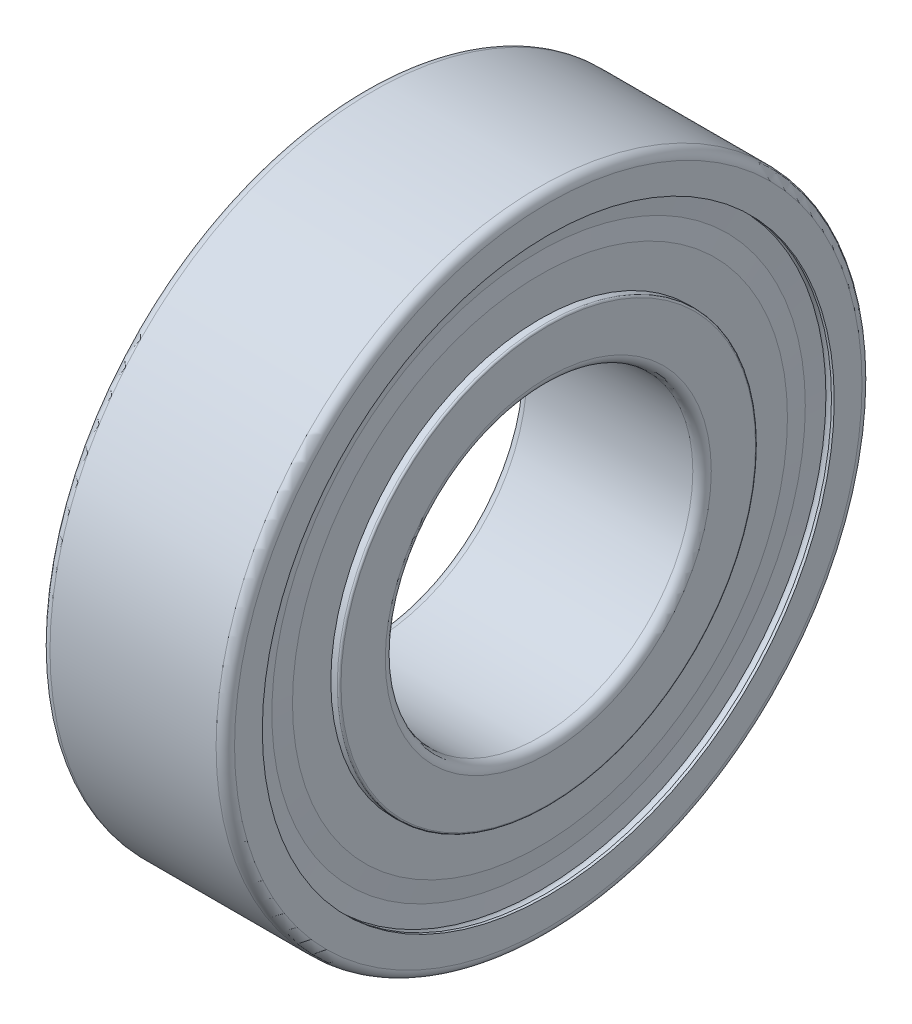
ISO-10303-21;
HEADER;
FILE_DESCRIPTION(('STEP AP214'),'2;1');
FILE_NAME('part.step','',(''),(''),'','','');
FILE_SCHEMA(('AUTOMOTIVE_DESIGN { 1 0 10303 214 1 1 1 1 }'));
ENDSEC;
DATA;
#1=APPLICATION_CONTEXT('core data for automotive mechanical design processes');
#2=APPLICATION_PROTOCOL_DEFINITION('international standard','automotive_design',2000,#1);
#3=PRODUCT_CONTEXT('',#1,'mechanical');
#4=PRODUCT('Part','Part','',(#3));
#5=PRODUCT_RELATED_PRODUCT_CATEGORY('part','',(#4));
#6=PRODUCT_DEFINITION_FORMATION('','',#4);
#7=PRODUCT_DEFINITION_CONTEXT('part definition',#1,'design');
#8=PRODUCT_DEFINITION('design','',#6,#7);
#9=PRODUCT_DEFINITION_SHAPE('','',#8);
#10=(LENGTH_UNIT() NAMED_UNIT(*) SI_UNIT(.MILLI.,.METRE.));
#11=(NAMED_UNIT(*) PLANE_ANGLE_UNIT() SI_UNIT($,.RADIAN.));
#12=(NAMED_UNIT(*) SI_UNIT($,.STERADIAN.) SOLID_ANGLE_UNIT());
#13=UNCERTAINTY_MEASURE_WITH_UNIT(LENGTH_MEASURE(1.E-05),#10,'distance_accuracy_value','');
#14=(GEOMETRIC_REPRESENTATION_CONTEXT(3) GLOBAL_UNCERTAINTY_ASSIGNED_CONTEXT((#13)) GLOBAL_UNIT_ASSIGNED_CONTEXT((#10,
#11,#12)) REPRESENTATION_CONTEXT('',''));
#15=CARTESIAN_POINT('',(0.,0.,0.));
#16=DIRECTION('',(0.,0.,1.));
#17=DIRECTION('',(1.,0.,0.));
#18=AXIS2_PLACEMENT_3D('',#15,#16,#17);
#19=CARTESIAN_POINT('',(50.,0.,0.));
#20=DIRECTION('',(1.,0.,0.));
#21=DIRECTION('',(0.,0.,-1.));
#22=AXIS2_PLACEMENT_3D('',#19,#20,#21);
#23=CYLINDRICAL_SURFACE('',#22,18.595);
#24=CARTESIAN_POINT('',(11.46,0.,0.));
#25=DIRECTION('',(1.,0.,0.));
#26=DIRECTION('',(0.,0.,-1.));
#27=AXIS2_PLACEMENT_3D('',#24,#25,#26);
#28=CIRCLE('',#27,18.595);
#29=CARTESIAN_POINT('',(11.46,0.,-18.595));
#30=VERTEX_POINT('',#29);
#31=EDGE_CURVE('P0_E11',#30,#30,#28,.T.);
#32=ORIENTED_EDGE('',*,*,#31,.F.);
#33=EDGE_LOOP('',(#32));
#34=FACE_BOUND('',#33,.T.);
#35=CARTESIAN_POINT('',(11.28,0.,0.));
#36=DIRECTION('',(1.,0.,0.));
#37=DIRECTION('',(0.,0.,-1.));
#38=AXIS2_PLACEMENT_3D('',#35,#36,#37);
#39=CIRCLE('',#38,18.595);
#40=CARTESIAN_POINT('',(11.28,0.,-18.595));
#41=VERTEX_POINT('',#40);
#42=EDGE_CURVE('P0_E187',#41,#41,#39,.T.);
#43=ORIENTED_EDGE('',*,*,#42,.T.);
#44=EDGE_LOOP('',(#43));
#45=FACE_BOUND('',#44,.T.);
#46=ADVANCED_FACE('P0_F17',(#34,#45),#23,.T.);
#47=CARTESIAN_POINT('',(11.37,0.,0.));
#48=DIRECTION('',(1.,0.,0.));
#49=DIRECTION('',(0.,0.,-1.));
#50=AXIS2_PLACEMENT_3D('',#47,#48,#49);
#51=CONICAL_SURFACE('',#50,17.34375,1.49899191472693);
#52=CARTESIAN_POINT('',(11.37,0.,0.));
#53=DIRECTION('',(1.,0.,0.));
#54=DIRECTION('',(0.,0.,-1.));
#55=AXIS2_PLACEMENT_3D('',#52,#53,#54);
#56=CIRCLE('',#55,17.34375);
#57=CARTESIAN_POINT('',(11.37,0.,-17.34375));
#58=VERTEX_POINT('',#57);
#59=EDGE_CURVE('P0_E28',#58,#58,#56,.T.);
#60=ORIENTED_EDGE('',*,*,#59,.F.);
#61=EDGE_LOOP('',(#60));
#62=FACE_BOUND('',#61,.T.);
#63=ORIENTED_EDGE('',*,*,#31,.T.);
#64=EDGE_LOOP('',(#63));
#65=FACE_BOUND('',#64,.T.);
#66=ADVANCED_FACE('P0_F268',(#62,#65),#51,.F.);
#67=CARTESIAN_POINT('',(11.46,0.,0.));
#68=DIRECTION('',(-1.,0.,0.));
#69=DIRECTION('',(0.,0.,1.));
#70=AXIS2_PLACEMENT_3D('',#67,#68,#69);
#71=CONICAL_SURFACE('',#70,16.0925,1.49899191472693);
#72=CARTESIAN_POINT('',(11.46,0.,0.));
#73=DIRECTION('',(1.,0.,0.));
#74=DIRECTION('',(0.,0.,-1.));
#75=AXIS2_PLACEMENT_3D('',#72,#73,#74);
#76=CIRCLE('',#75,16.0925);
#77=CARTESIAN_POINT('',(11.46,0.,-16.0925));
#78=VERTEX_POINT('',#77);
#79=EDGE_CURVE('P0_E169',#78,#78,#76,.T.);
#80=ORIENTED_EDGE('',*,*,#79,.F.);
#81=EDGE_LOOP('',(#80));
#82=FACE_BOUND('',#81,.T.);
#83=ORIENTED_EDGE('',*,*,#59,.T.);
#84=EDGE_LOOP('',(#83));
#85=FACE_BOUND('',#84,.T.);
#86=ADVANCED_FACE('P0_F19',(#82,#85),#71,.T.);
#87=CARTESIAN_POINT('',(11.46,13.59,0.));
#88=DIRECTION('',(1.,0.,0.));
#89=DIRECTION('',(0.,1.,0.));
#90=AXIS2_PLACEMENT_3D('',#87,#88,#89);
#91=PLANE('',#90);
#92=CARTESIAN_POINT('',(11.46,0.,0.));
#93=DIRECTION('',(-1.,0.,0.));
#94=DIRECTION('',(0.,0.,-1.));
#95=AXIS2_PLACEMENT_3D('',#92,#93,#94);
#96=CIRCLE('',#95,13.6);
#97=CARTESIAN_POINT('',(11.46,0.,-13.6));
#98=VERTEX_POINT('',#97);
#99=EDGE_CURVE('P0_E91',#98,#98,#96,.T.);
#100=ORIENTED_EDGE('',*,*,#99,.T.);
#101=EDGE_LOOP('',(#100));
#102=FACE_BOUND('',#101,.T.);
#103=ORIENTED_EDGE('',*,*,#79,.T.);
#104=EDGE_LOOP('',(#103));
#105=FACE_BOUND('',#104,.T.);
#106=ADVANCED_FACE('P0_F298',(#102,#105),#91,.T.);
#107=CARTESIAN_POINT('',(11.1,0.,0.));
#108=DIRECTION('',(-1.,0.,0.));
#109=DIRECTION('',(0.,0.,1.));
#110=AXIS2_PLACEMENT_3D('',#107,#108,#109);
#111=CONICAL_SURFACE('',#110,16.0925,1.49899191472693);
#112=CARTESIAN_POINT('',(11.1,0.,0.));
#113=DIRECTION('',(1.,0.,0.));
#114=DIRECTION('',(0.,0.,-1.));
#115=AXIS2_PLACEMENT_3D('',#112,#113,#114);
#116=CIRCLE('',#115,16.0925);
#117=CARTESIAN_POINT('',(11.1,0.,-16.0925));
#118=VERTEX_POINT('',#117);
#119=EDGE_CURVE('P0_E21',#118,#118,#116,.T.);
#120=ORIENTED_EDGE('',*,*,#119,.F.);
#121=EDGE_LOOP('',(#120));
#122=FACE_BOUND('',#121,.T.);
#123=CARTESIAN_POINT('',(11.2792807192807,0.,0.));
#124=DIRECTION('',(1.,0.,0.));
#125=DIRECTION('',(0.,0.,1.));
#126=AXIS2_PLACEMENT_3D('',#123,#124,#125);
#127=CIRCLE('',#126,13.6);
#128=CARTESIAN_POINT('',(11.2792807192807,0.,13.6));
#129=VERTEX_POINT('',#128);
#130=EDGE_CURVE('P0_E177',#129,#129,#127,.T.);
#131=ORIENTED_EDGE('',*,*,#130,.T.);
#132=EDGE_LOOP('',(#131));
#133=FACE_BOUND('',#132,.T.);
#134=ADVANCED_FACE('P0_F223',(#122,#133),#111,.F.);
#135=CARTESIAN_POINT('',(11.1,17.34375,0.));
#136=DIRECTION('',(-1.,0.,0.));
#137=DIRECTION('',(0.,0.,1.));
#138=AXIS2_PLACEMENT_3D('',#135,#136,#137);
#139=PLANE('',#138);
#140=CARTESIAN_POINT('',(11.1,0.,0.));
#141=DIRECTION('',(1.,0.,0.));
#142=DIRECTION('',(0.,0.,-1.));
#143=AXIS2_PLACEMENT_3D('',#140,#141,#142);
#144=CIRCLE('',#143,17.34375);
#145=CARTESIAN_POINT('',(11.1,0.,-17.34375));
#146=VERTEX_POINT('',#145);
#147=EDGE_CURVE('P0_E185',#146,#146,#144,.T.);
#148=ORIENTED_EDGE('',*,*,#147,.F.);
#149=EDGE_LOOP('',(#148));
#150=FACE_BOUND('',#149,.T.);
#151=ORIENTED_EDGE('',*,*,#119,.T.);
#152=EDGE_LOOP('',(#151));
#153=FACE_BOUND('',#152,.T.);
#154=ADVANCED_FACE('P0_F220',(#150,#153),#139,.T.);
#155=CARTESIAN_POINT('',(11.28,0.,0.));
#156=DIRECTION('',(1.,0.,0.));
#157=DIRECTION('',(0.,0.,-1.));
#158=AXIS2_PLACEMENT_3D('',#155,#156,#157);
#159=CONICAL_SURFACE('',#158,18.595,1.42792038843124);
#160=ORIENTED_EDGE('',*,*,#42,.F.);
#161=EDGE_LOOP('',(#160));
#162=FACE_BOUND('',#161,.T.);
#163=ORIENTED_EDGE('',*,*,#147,.T.);
#164=EDGE_LOOP('',(#163));
#165=FACE_BOUND('',#164,.T.);
#166=ADVANCED_FACE('P0_F218',(#162,#165),#159,.T.);
#167=CARTESIAN_POINT('',(0.9,0.,0.));
#168=DIRECTION('',(-1.,0.,0.));
#169=DIRECTION('',(0.,0.,1.));
#170=AXIS2_PLACEMENT_3D('',#167,#168,#169);
#171=CONICAL_SURFACE('',#170,17.34375,1.42792038843124);
#172=CARTESIAN_POINT('',(0.9,0.,0.));
#173=DIRECTION('',(1.,0.,0.));
#174=DIRECTION('',(0.,0.,-1.));
#175=AXIS2_PLACEMENT_3D('',#172,#173,#174);
#176=CIRCLE('',#175,17.34375);
#177=CARTESIAN_POINT('',(0.9,0.,-17.34375));
#178=VERTEX_POINT('',#177);
#179=EDGE_CURVE('P0_E182',#178,#178,#176,.T.);
#180=ORIENTED_EDGE('',*,*,#179,.F.);
#181=EDGE_LOOP('',(#180));
#182=FACE_BOUND('',#181,.T.);
#183=CARTESIAN_POINT('',(0.72,0.,0.));
#184=DIRECTION('',(1.,0.,0.));
#185=DIRECTION('',(0.,0.,-1.));
#186=AXIS2_PLACEMENT_3D('',#183,#184,#185);
#187=CIRCLE('',#186,18.595);
#188=CARTESIAN_POINT('',(0.72,0.,-18.595));
#189=VERTEX_POINT('',#188);
#190=EDGE_CURVE('P0_E193',#189,#189,#187,.T.);
#191=ORIENTED_EDGE('',*,*,#190,.T.);
#192=EDGE_LOOP('',(#191));
#193=FACE_BOUND('',#192,.T.);
#194=ADVANCED_FACE('P0_F316',(#182,#193),#171,.T.);
#195=CARTESIAN_POINT('',(0.9,16.0925,0.));
#196=DIRECTION('',(1.,0.,0.));
#197=DIRECTION('',(0.,1.,0.));
#198=AXIS2_PLACEMENT_3D('',#195,#196,#197);
#199=PLANE('',#198);
#200=CARTESIAN_POINT('',(0.9,0.,0.));
#201=DIRECTION('',(1.,0.,0.));
#202=DIRECTION('',(0.,0.,-1.));
#203=AXIS2_PLACEMENT_3D('',#200,#201,#202);
#204=CIRCLE('',#203,16.0925);
#205=CARTESIAN_POINT('',(0.9,0.,-16.0925));
#206=VERTEX_POINT('',#205);
#207=EDGE_CURVE('P0_E186',#206,#206,#204,.T.);
#208=ORIENTED_EDGE('',*,*,#207,.F.);
#209=EDGE_LOOP('',(#208));
#210=FACE_BOUND('',#209,.T.);
#211=ORIENTED_EDGE('',*,*,#179,.T.);
#212=EDGE_LOOP('',(#211));
#213=FACE_BOUND('',#212,.T.);
#214=ADVANCED_FACE('P0_F284',(#210,#213),#199,.T.);
#215=CARTESIAN_POINT('',(0.72,0.,0.));
#216=DIRECTION('',(1.,0.,0.));
#217=DIRECTION('',(0.,0.,-1.));
#218=AXIS2_PLACEMENT_3D('',#215,#216,#217);
#219=CONICAL_SURFACE('',#218,13.59,1.49899191472693);
#220=CARTESIAN_POINT('',(0.720719280719279,0.,0.));
#221=DIRECTION('',(-1.,0.,0.));
#222=DIRECTION('',(0.,0.,-1.));
#223=AXIS2_PLACEMENT_3D('',#220,#221,#222);
#224=CIRCLE('',#223,13.6);
#225=CARTESIAN_POINT('',(0.720719280719279,0.,-13.6));
#226=VERTEX_POINT('',#225);
#227=EDGE_CURVE('P0_E203',#226,#226,#224,.T.);
#228=ORIENTED_EDGE('',*,*,#227,.T.);
#229=EDGE_LOOP('',(#228));
#230=FACE_BOUND('',#229,.T.);
#231=ORIENTED_EDGE('',*,*,#207,.T.);
#232=EDGE_LOOP('',(#231));
#233=FACE_BOUND('',#232,.T.);
#234=ADVANCED_FACE('P0_F280',(#230,#233),#219,.F.);
#235=CARTESIAN_POINT('',(0.54,16.0925,0.));
#236=DIRECTION('',(-1.,0.,0.));
#237=DIRECTION('',(0.,0.,1.));
#238=AXIS2_PLACEMENT_3D('',#235,#236,#237);
#239=PLANE('',#238);
#240=CARTESIAN_POINT('',(0.54,0.,0.));
#241=DIRECTION('',(1.,0.,0.));
#242=DIRECTION('',(0.,0.,-1.));
#243=AXIS2_PLACEMENT_3D('',#240,#241,#242);
#244=CIRCLE('',#243,16.0925);
#245=CARTESIAN_POINT('',(0.54,0.,-16.0925));
#246=VERTEX_POINT('',#245);
#247=EDGE_CURVE('P0_E190',#246,#246,#244,.T.);
#248=ORIENTED_EDGE('',*,*,#247,.F.);
#249=EDGE_LOOP('',(#248));
#250=FACE_BOUND('',#249,.T.);
#251=CARTESIAN_POINT('',(0.54,0.,0.));
#252=DIRECTION('',(1.,0.,0.));
#253=DIRECTION('',(0.,0.,1.));
#254=AXIS2_PLACEMENT_3D('',#251,#252,#253);
#255=CIRCLE('',#254,13.6);
#256=CARTESIAN_POINT('',(0.54,0.,13.6));
#257=VERTEX_POINT('',#256);
#258=EDGE_CURVE('P0_E172',#257,#257,#255,.T.);
#259=ORIENTED_EDGE('',*,*,#258,.T.);
#260=EDGE_LOOP('',(#259));
#261=FACE_BOUND('',#260,.T.);
#262=ADVANCED_FACE('P0_F283',(#250,#261),#239,.T.);
#263=CARTESIAN_POINT('',(0.63,0.,0.));
#264=DIRECTION('',(1.,0.,0.));
#265=DIRECTION('',(0.,0.,-1.));
#266=AXIS2_PLACEMENT_3D('',#263,#264,#265);
#267=CONICAL_SURFACE('',#266,17.34375,1.49899191472693);
#268=CARTESIAN_POINT('',(0.63,0.,0.));
#269=DIRECTION('',(1.,0.,0.));
#270=DIRECTION('',(0.,0.,-1.));
#271=AXIS2_PLACEMENT_3D('',#268,#269,#270);
#272=CIRCLE('',#271,17.34375);
#273=CARTESIAN_POINT('',(0.63,0.,-17.34375));
#274=VERTEX_POINT('',#273);
#275=EDGE_CURVE('P0_E192',#274,#274,#272,.T.);
#276=ORIENTED_EDGE('',*,*,#275,.F.);
#277=EDGE_LOOP('',(#276));
#278=FACE_BOUND('',#277,.T.);
#279=ORIENTED_EDGE('',*,*,#247,.T.);
#280=EDGE_LOOP('',(#279));
#281=FACE_BOUND('',#280,.T.);
#282=ADVANCED_FACE('P0_F304',(#278,#281),#267,.T.);
#283=CARTESIAN_POINT('',(0.54,0.,0.));
#284=DIRECTION('',(-1.,0.,0.));
#285=DIRECTION('',(0.,0.,1.));
#286=AXIS2_PLACEMENT_3D('',#283,#284,#285);
#287=CONICAL_SURFACE('',#286,18.595,1.49899191472693);
#288=CARTESIAN_POINT('',(0.54,0.,0.));
#289=DIRECTION('',(1.,0.,0.));
#290=DIRECTION('',(0.,0.,-1.));
#291=AXIS2_PLACEMENT_3D('',#288,#289,#290);
#292=CIRCLE('',#291,18.595);
#293=CARTESIAN_POINT('',(0.54,0.,-18.595));
#294=VERTEX_POINT('',#293);
#295=EDGE_CURVE('P0_E195',#294,#294,#292,.T.);
#296=ORIENTED_EDGE('',*,*,#295,.F.);
#297=EDGE_LOOP('',(#296));
#298=FACE_BOUND('',#297,.T.);
#299=ORIENTED_EDGE('',*,*,#275,.T.);
#300=EDGE_LOOP('',(#299));
#301=FACE_BOUND('',#300,.T.);
#302=ADVANCED_FACE('P0_F307',(#298,#301),#287,.F.);
#303=CARTESIAN_POINT('',(50.,0.,0.));
#304=DIRECTION('',(1.,0.,0.));
#305=DIRECTION('',(0.,0.,-1.));
#306=AXIS2_PLACEMENT_3D('',#303,#304,#305);
#307=CYLINDRICAL_SURFACE('',#306,18.595);
#308=ORIENTED_EDGE('',*,*,#190,.F.);
#309=EDGE_LOOP('',(#308));
#310=FACE_BOUND('',#309,.T.);
#311=ORIENTED_EDGE('',*,*,#295,.T.);
#312=EDGE_LOOP('',(#311));
#313=FACE_BOUND('',#312,.T.);
#314=ADVANCED_FACE('P0_F263',(#310,#313),#307,.T.);
#315=CARTESIAN_POINT('',(50.,0.,0.));
#316=DIRECTION('',(1.,0.,0.));
#317=DIRECTION('',(0.,0.,-1.));
#318=AXIS2_PLACEMENT_3D('',#315,#316,#317);
#319=CYLINDRICAL_SURFACE('',#318,13.6);
#320=CARTESIAN_POINT('',(3.45625767814427,0.,0.));
#321=DIRECTION('',(1.,0.,0.));
#322=DIRECTION('',(0.,0.,-1.));
#323=AXIS2_PLACEMENT_3D('',#320,#321,#322);
#324=CIRCLE('',#323,13.6);
#325=CARTESIAN_POINT('',(3.45625767814427,0.,-13.6));
#326=VERTEX_POINT('',#325);
#327=EDGE_CURVE('P0_E210',#326,#326,#324,.T.);
#328=ORIENTED_EDGE('',*,*,#327,.F.);
#329=EDGE_LOOP('',(#328));
#330=FACE_BOUND('',#329,.T.);
#331=ORIENTED_EDGE('',*,*,#227,.F.);
#332=EDGE_LOOP('',(#331));
#333=FACE_BOUND('',#332,.T.);
#334=ADVANCED_FACE('P0_F251',(#330,#333),#319,.T.);
#335=CARTESIAN_POINT('',(6.,0.,0.));
#336=DIRECTION('',(1.,0.,0.));
#337=DIRECTION('',(0.,0.,-1.));
#338=AXIS2_PLACEMENT_3D('',#335,#336,#337);
#339=TOROIDAL_SURFACE('',#338,15.5,3.175);
#340=ORIENTED_EDGE('',*,*,#327,.T.);
#341=EDGE_LOOP('',(#340));
#342=FACE_BOUND('',#341,.T.);
#343=CARTESIAN_POINT('',(8.54374232185574,0.,0.));
#344=DIRECTION('',(1.,0.,0.));
#345=DIRECTION('',(0.,0.,-1.));
#346=AXIS2_PLACEMENT_3D('',#343,#344,#345);
#347=CIRCLE('',#346,13.6);
#348=CARTESIAN_POINT('',(8.54374232185574,0.,-13.6));
#349=VERTEX_POINT('',#348);
#350=EDGE_CURVE('P0_E181',#349,#349,#347,.T.);
#351=ORIENTED_EDGE('',*,*,#350,.F.);
#352=EDGE_LOOP('',(#351));
#353=FACE_BOUND('',#352,.T.);
#354=ADVANCED_FACE('P0_F248',(#342,#353),#339,.F.);
#355=CARTESIAN_POINT('',(50.,0.,0.));
#356=DIRECTION('',(1.,0.,0.));
#357=DIRECTION('',(0.,0.,-1.));
#358=AXIS2_PLACEMENT_3D('',#355,#356,#357);
#359=CYLINDRICAL_SURFACE('',#358,13.6);
#360=CARTESIAN_POINT('',(11.88,0.,0.));
#361=DIRECTION('',(1.,0.,0.));
#362=DIRECTION('',(0.,0.,-1.));
#363=AXIS2_PLACEMENT_3D('',#360,#361,#362);
#364=CIRCLE('',#363,13.6);
#365=CARTESIAN_POINT('',(11.88,0.,-13.6));
#366=VERTEX_POINT('',#365);
#367=EDGE_CURVE('P0_E104',#366,#366,#364,.T.);
#368=ORIENTED_EDGE('',*,*,#367,.F.);
#369=EDGE_LOOP('',(#368));
#370=FACE_BOUND('',#369,.T.);
#371=ORIENTED_EDGE('',*,*,#99,.F.);
#372=EDGE_LOOP('',(#371));
#373=FACE_BOUND('',#372,.T.);
#374=ADVANCED_FACE('P0_F250',(#370,#373),#359,.T.);
#375=CARTESIAN_POINT('',(11.88,0.,0.));
#376=DIRECTION('',(1.,0.,0.));
#377=DIRECTION('',(0.,0.,-1.));
#378=AXIS2_PLACEMENT_3D('',#375,#376,#377);
#379=TOROIDAL_SURFACE('',#378,13.48,0.12);
#380=CARTESIAN_POINT('',(12.,0.,0.));
#381=DIRECTION('',(1.,0.,0.));
#382=DIRECTION('',(0.,0.,-1.));
#383=AXIS2_PLACEMENT_3D('',#380,#381,#382);
#384=CIRCLE('',#383,13.48);
#385=CARTESIAN_POINT('',(12.,0.,-13.48));
#386=VERTEX_POINT('',#385);
#387=EDGE_CURVE('P0_E152',#386,#386,#384,.T.);
#388=ORIENTED_EDGE('',*,*,#387,.F.);
#389=EDGE_LOOP('',(#388));
#390=FACE_BOUND('',#389,.T.);
#391=ORIENTED_EDGE('',*,*,#367,.T.);
#392=EDGE_LOOP('',(#391));
#393=FACE_BOUND('',#392,.T.);
#394=ADVANCED_FACE('P0_F260',(#390,#393),#379,.T.);
#395=CARTESIAN_POINT('',(12.,10.6,0.));
#396=DIRECTION('',(1.,0.,0.));
#397=DIRECTION('',(0.,1.,0.));
#398=AXIS2_PLACEMENT_3D('',#395,#396,#397);
#399=PLANE('',#398);
#400=CARTESIAN_POINT('',(12.,0.,0.));
#401=DIRECTION('',(1.,0.,0.));
#402=DIRECTION('',(0.,0.,-1.));
#403=AXIS2_PLACEMENT_3D('',#400,#401,#402);
#404=CIRCLE('',#403,10.6);
#405=CARTESIAN_POINT('',(12.,0.,-10.6));
#406=VERTEX_POINT('',#405);
#407=EDGE_CURVE('P0_E144',#406,#406,#404,.T.);
#408=ORIENTED_EDGE('',*,*,#407,.F.);
#409=EDGE_LOOP('',(#408));
#410=FACE_BOUND('',#409,.T.);
#411=ORIENTED_EDGE('',*,*,#387,.T.);
#412=EDGE_LOOP('',(#411));
#413=FACE_BOUND('',#412,.T.);
#414=ADVANCED_FACE('P0_F299',(#410,#413),#399,.T.);
#415=CARTESIAN_POINT('',(11.4,0.,0.));
#416=DIRECTION('',(1.,0.,0.));
#417=DIRECTION('',(0.,0.,-1.));
#418=AXIS2_PLACEMENT_3D('',#415,#416,#417);
#419=TOROIDAL_SURFACE('',#418,10.6,0.6);
#420=CARTESIAN_POINT('',(11.4,0.,0.));
#421=DIRECTION('',(1.,0.,0.));
#422=DIRECTION('',(0.,0.,-1.));
#423=AXIS2_PLACEMENT_3D('',#420,#421,#422);
#424=CIRCLE('',#423,10.);
#425=CARTESIAN_POINT('',(11.4,0.,-10.));
#426=VERTEX_POINT('',#425);
#427=EDGE_CURVE('P0_E140',#426,#426,#424,.T.);
#428=ORIENTED_EDGE('',*,*,#427,.F.);
#429=EDGE_LOOP('',(#428));
#430=FACE_BOUND('',#429,.T.);
#431=ORIENTED_EDGE('',*,*,#407,.T.);
#432=EDGE_LOOP('',(#431));
#433=FACE_BOUND('',#432,.T.);
#434=ADVANCED_FACE('P0_F302',(#430,#433),#419,.T.);
#435=CARTESIAN_POINT('',(50.,0.,0.));
#436=DIRECTION('',(1.,0.,0.));
#437=DIRECTION('',(0.,0.,-1.));
#438=AXIS2_PLACEMENT_3D('',#435,#436,#437);
#439=CYLINDRICAL_SURFACE('',#438,10.);
#440=CARTESIAN_POINT('',(0.6,0.,0.));
#441=DIRECTION('',(1.,0.,0.));
#442=DIRECTION('',(0.,0.,-1.));
#443=AXIS2_PLACEMENT_3D('',#440,#441,#442);
#444=CIRCLE('',#443,10.);
#445=CARTESIAN_POINT('',(0.6,0.,-10.));
#446=VERTEX_POINT('',#445);
#447=EDGE_CURVE('P0_E145',#446,#446,#444,.T.);
#448=ORIENTED_EDGE('',*,*,#447,.F.);
#449=EDGE_LOOP('',(#448));
#450=FACE_BOUND('',#449,.T.);
#451=ORIENTED_EDGE('',*,*,#427,.T.);
#452=EDGE_LOOP('',(#451));
#453=FACE_BOUND('',#452,.T.);
#454=ADVANCED_FACE('P0_F141',(#450,#453),#439,.F.);
#455=CARTESIAN_POINT('',(0.6,0.,0.));
#456=DIRECTION('',(1.,0.,0.));
#457=DIRECTION('',(0.,0.,-1.));
#458=AXIS2_PLACEMENT_3D('',#455,#456,#457);
#459=TOROIDAL_SURFACE('',#458,10.6,0.6);
#460=CARTESIAN_POINT('',(0.,0.,0.));
#461=DIRECTION('',(1.,0.,0.));
#462=DIRECTION('',(0.,0.,-1.));
#463=AXIS2_PLACEMENT_3D('',#460,#461,#462);
#464=CIRCLE('',#463,10.6);
#465=CARTESIAN_POINT('',(0.,0.,-10.6));
#466=VERTEX_POINT('',#465);
#467=EDGE_CURVE('P0_E154',#466,#466,#464,.T.);
#468=ORIENTED_EDGE('',*,*,#467,.F.);
#469=EDGE_LOOP('',(#468));
#470=FACE_BOUND('',#469,.T.);
#471=ORIENTED_EDGE('',*,*,#447,.T.);
#472=EDGE_LOOP('',(#471));
#473=FACE_BOUND('',#472,.T.);
#474=ADVANCED_FACE('P0_F286',(#470,#473),#459,.T.);
#475=CARTESIAN_POINT('',(0.,13.48,0.));
#476=DIRECTION('',(-1.,0.,0.));
#477=DIRECTION('',(0.,0.,1.));
#478=AXIS2_PLACEMENT_3D('',#475,#476,#477);
#479=PLANE('',#478);
#480=CARTESIAN_POINT('',(0.,0.,0.));
#481=DIRECTION('',(1.,0.,0.));
#482=DIRECTION('',(0.,0.,-1.));
#483=AXIS2_PLACEMENT_3D('',#480,#481,#482);
#484=CIRCLE('',#483,13.48);
#485=CARTESIAN_POINT('',(0.,0.,-13.48));
#486=VERTEX_POINT('',#485);
#487=EDGE_CURVE('P0_E162',#486,#486,#484,.T.);
#488=ORIENTED_EDGE('',*,*,#487,.F.);
#489=EDGE_LOOP('',(#488));
#490=FACE_BOUND('',#489,.T.);
#491=ORIENTED_EDGE('',*,*,#467,.T.);
#492=EDGE_LOOP('',(#491));
#493=FACE_BOUND('',#492,.T.);
#494=ADVANCED_FACE('P0_F289',(#490,#493),#479,.T.);
#495=CARTESIAN_POINT('',(0.12,0.,0.));
#496=DIRECTION('',(1.,0.,0.));
#497=DIRECTION('',(0.,0.,-1.));
#498=AXIS2_PLACEMENT_3D('',#495,#496,#497);
#499=TOROIDAL_SURFACE('',#498,13.48,0.12);
#500=CARTESIAN_POINT('',(0.120000000000002,0.,0.));
#501=DIRECTION('',(1.,0.,0.));
#502=DIRECTION('',(0.,0.,-1.));
#503=AXIS2_PLACEMENT_3D('',#500,#501,#502);
#504=CIRCLE('',#503,13.6);
#505=CARTESIAN_POINT('',(0.120000000000002,0.,-13.6));
#506=VERTEX_POINT('',#505);
#507=EDGE_CURVE('P0_E175',#506,#506,#504,.T.);
#508=ORIENTED_EDGE('',*,*,#507,.F.);
#509=EDGE_LOOP('',(#508));
#510=FACE_BOUND('',#509,.T.);
#511=ORIENTED_EDGE('',*,*,#487,.T.);
#512=EDGE_LOOP('',(#511));
#513=FACE_BOUND('',#512,.T.);
#514=ADVANCED_FACE('P0_F291',(#510,#513),#499,.T.);
#515=CARTESIAN_POINT('',(50.,0.,0.));
#516=DIRECTION('',(1.,0.,0.));
#517=DIRECTION('',(0.,0.,-1.));
#518=AXIS2_PLACEMENT_3D('',#515,#516,#517);
#519=CYLINDRICAL_SURFACE('',#518,13.6);
#520=ORIENTED_EDGE('',*,*,#258,.F.);
#521=EDGE_LOOP('',(#520));
#522=FACE_BOUND('',#521,.T.);
#523=ORIENTED_EDGE('',*,*,#507,.T.);
#524=EDGE_LOOP('',(#523));
#525=FACE_BOUND('',#524,.T.);
#526=ADVANCED_FACE('P0_F294',(#522,#525),#519,.T.);
#527=CARTESIAN_POINT('',(50.,0.,0.));
#528=DIRECTION('',(1.,0.,0.));
#529=DIRECTION('',(0.,0.,-1.));
#530=AXIS2_PLACEMENT_3D('',#527,#528,#529);
#531=CYLINDRICAL_SURFACE('',#530,13.6);
#532=ORIENTED_EDGE('',*,*,#130,.F.);
#533=EDGE_LOOP('',(#532));
#534=FACE_BOUND('',#533,.T.);
#535=ORIENTED_EDGE('',*,*,#350,.T.);
#536=EDGE_LOOP('',(#535));
#537=FACE_BOUND('',#536,.T.);
#538=ADVANCED_FACE('P0_F246',(#534,#537),#531,.T.);
#539=CLOSED_SHELL('',(#46,#66,#86,#106,#134,#154,#166,#194,#214,#234,#262,#282,#302,#314,#334,
#354,#374,#394,#414,#434,#454,#474,#494,#514,#526,#538));
#540=MANIFOLD_SOLID_BREP('P0_B1',#539);
#541=CARTESIAN_POINT('',(50.,0.,0.));
#542=DIRECTION('',(1.,0.,0.));
#543=DIRECTION('',(0.,0.,-1.));
#544=AXIS2_PLACEMENT_3D('',#541,#542,#543);
#545=CYLINDRICAL_SURFACE('',#544,21.);
#546=CARTESIAN_POINT('',(11.4,0.,0.));
#547=DIRECTION('',(1.,0.,0.));
#548=DIRECTION('',(0.,0.,-1.));
#549=AXIS2_PLACEMENT_3D('',#546,#547,#548);
#550=CIRCLE('',#549,21.);
#551=CARTESIAN_POINT('',(11.4,0.,-21.));
#552=VERTEX_POINT('',#551);
#553=EDGE_CURVE('P1_E11',#552,#552,#550,.T.);
#554=ORIENTED_EDGE('',*,*,#553,.F.);
#555=EDGE_LOOP('',(#554));
#556=FACE_BOUND('',#555,.T.);
#557=CARTESIAN_POINT('',(0.6,0.,0.));
#558=DIRECTION('',(1.,0.,0.));
#559=DIRECTION('',(0.,0.,-1.));
#560=AXIS2_PLACEMENT_3D('',#557,#558,#559);
#561=CIRCLE('',#560,21.);
#562=CARTESIAN_POINT('',(0.6,0.,-21.));
#563=VERTEX_POINT('',#562);
#564=EDGE_CURVE('P1_E118',#563,#563,#561,.T.);
#565=ORIENTED_EDGE('',*,*,#564,.T.);
#566=EDGE_LOOP('',(#565));
#567=FACE_BOUND('',#566,.T.);
#568=ADVANCED_FACE('P1_F17',(#556,#567),#545,.T.);
#569=CARTESIAN_POINT('',(11.4,0.,0.));
#570=DIRECTION('',(1.,0.,0.));
#571=DIRECTION('',(0.,0.,-1.));
#572=AXIS2_PLACEMENT_3D('',#569,#570,#571);
#573=TOROIDAL_SURFACE('',#572,20.4,0.600000000000007);
#574=CARTESIAN_POINT('',(12.,0.,0.));
#575=DIRECTION('',(1.,0.,0.));
#576=DIRECTION('',(0.,0.,-1.));
#577=AXIS2_PLACEMENT_3D('',#574,#575,#576);
#578=CIRCLE('',#577,20.4);
#579=CARTESIAN_POINT('',(12.,0.,-20.4));
#580=VERTEX_POINT('',#579);
#581=EDGE_CURVE('P1_E28',#580,#580,#578,.T.);
#582=ORIENTED_EDGE('',*,*,#581,.F.);
#583=EDGE_LOOP('',(#582));
#584=FACE_BOUND('',#583,.T.);
#585=ORIENTED_EDGE('',*,*,#553,.T.);
#586=EDGE_LOOP('',(#585));
#587=FACE_BOUND('',#586,.T.);
#588=ADVANCED_FACE('P1_F155',(#584,#587),#573,.T.);
#589=CARTESIAN_POINT('',(12.,18.595,0.));
#590=DIRECTION('',(1.,0.,0.));
#591=DIRECTION('',(0.,1.,0.));
#592=AXIS2_PLACEMENT_3D('',#589,#590,#591);
#593=PLANE('',#592);
#594=CARTESIAN_POINT('',(12.,0.,0.));
#595=DIRECTION('',(1.,0.,0.));
#596=DIRECTION('',(0.,0.,-1.));
#597=AXIS2_PLACEMENT_3D('',#594,#595,#596);
#598=CIRCLE('',#597,18.595);
#599=CARTESIAN_POINT('',(12.,0.,-18.595));
#600=VERTEX_POINT('',#599);
#601=EDGE_CURVE('P1_E113',#600,#600,#598,.T.);
#602=ORIENTED_EDGE('',*,*,#601,.F.);
#603=EDGE_LOOP('',(#602));
#604=FACE_BOUND('',#603,.T.);
#605=ORIENTED_EDGE('',*,*,#581,.T.);
#606=EDGE_LOOP('',(#605));
#607=FACE_BOUND('',#606,.T.);
#608=ADVANCED_FACE('P1_F151',(#604,#607),#593,.T.);
#609=CARTESIAN_POINT('',(50.,0.,0.));
#610=DIRECTION('',(1.,0.,0.));
#611=DIRECTION('',(0.,0.,-1.));
#612=AXIS2_PLACEMENT_3D('',#609,#610,#611);
#613=CYLINDRICAL_SURFACE('',#612,18.595);
#614=CARTESIAN_POINT('',(11.82,0.,0.));
#615=DIRECTION('',(1.,0.,0.));
#616=DIRECTION('',(0.,0.,-1.));
#617=AXIS2_PLACEMENT_3D('',#614,#615,#616);
#618=CIRCLE('',#617,18.595);
#619=CARTESIAN_POINT('',(11.82,0.,-18.595));
#620=VERTEX_POINT('',#619);
#621=EDGE_CURVE('P1_E110',#620,#620,#618,.T.);
#622=ORIENTED_EDGE('',*,*,#621,.F.);
#623=EDGE_LOOP('',(#622));
#624=FACE_BOUND('',#623,.T.);
#625=ORIENTED_EDGE('',*,*,#601,.T.);
#626=EDGE_LOOP('',(#625));
#627=FACE_BOUND('',#626,.T.);
#628=ADVANCED_FACE('P1_F140',(#624,#627),#613,.F.);
#629=CARTESIAN_POINT('',(11.46,0.,0.));
#630=DIRECTION('',(1.,0.,0.));
#631=DIRECTION('',(0.,0.,-1.));
#632=AXIS2_PLACEMENT_3D('',#629,#630,#631);
#633=TOROIDAL_SURFACE('',#632,18.5950000189953,0.36);
#634=ORIENTED_EDGE('',*,*,#621,.T.);
#635=EDGE_LOOP('',(#634));
#636=FACE_BOUND('',#635,.T.);
#637=CARTESIAN_POINT('',(11.1,0.,0.));
#638=DIRECTION('',(1.,0.,0.));
#639=DIRECTION('',(0.,0.,-1.));
#640=AXIS2_PLACEMENT_3D('',#637,#638,#639);
#641=CIRCLE('',#640,18.595);
#642=CARTESIAN_POINT('',(11.1,0.,-18.595));
#643=VERTEX_POINT('',#642);
#644=EDGE_CURVE('P1_E114',#643,#643,#641,.T.);
#645=ORIENTED_EDGE('',*,*,#644,.F.);
#646=EDGE_LOOP('',(#645));
#647=FACE_BOUND('',#646,.T.);
#648=ADVANCED_FACE('P1_F19',(#636,#647),#633,.F.);
#649=CARTESIAN_POINT('',(10.8892892580534,0.,0.));
#650=DIRECTION('',(1.,0.,0.));
#651=DIRECTION('',(0.,0.,-1.));
#652=AXIS2_PLACEMENT_3D('',#649,#650,#651);
#653=CONICAL_SURFACE('',#652,17.4,1.39626340159546);
#654=CARTESIAN_POINT('',(10.8892892580534,0.,0.));
#655=DIRECTION('',(1.,0.,0.));
#656=DIRECTION('',(0.,0.,-1.));
#657=AXIS2_PLACEMENT_3D('',#654,#655,#656);
#658=CIRCLE('',#657,17.4);
#659=CARTESIAN_POINT('',(10.8892892580534,0.,-17.4));
#660=VERTEX_POINT('',#659);
#661=EDGE_CURVE('P1_E98',#660,#660,#658,.T.);
#662=ORIENTED_EDGE('',*,*,#661,.F.);
#663=EDGE_LOOP('',(#662));
#664=FACE_BOUND('',#663,.T.);
#665=ORIENTED_EDGE('',*,*,#644,.T.);
#666=EDGE_LOOP('',(#665));
#667=FACE_BOUND('',#666,.T.);
#668=ADVANCED_FACE('P1_F137',(#664,#667),#653,.F.);
#669=CARTESIAN_POINT('',(50.,0.,0.));
#670=DIRECTION('',(1.,0.,0.));
#671=DIRECTION('',(0.,0.,-1.));
#672=AXIS2_PLACEMENT_3D('',#669,#670,#671);
#673=CYLINDRICAL_SURFACE('',#672,17.4);
#674=CARTESIAN_POINT('',(8.54374232185574,0.,0.));
#675=DIRECTION('',(1.,0.,0.));
#676=DIRECTION('',(0.,0.,-1.));
#677=AXIS2_PLACEMENT_3D('',#674,#675,#676);
#678=CIRCLE('',#677,17.4);
#679=CARTESIAN_POINT('',(8.54374232185574,0.,-17.4));
#680=VERTEX_POINT('',#679);
#681=EDGE_CURVE('P1_E91',#680,#680,#678,.T.);
#682=ORIENTED_EDGE('',*,*,#681,.F.);
#683=EDGE_LOOP('',(#682));
#684=FACE_BOUND('',#683,.T.);
#685=ORIENTED_EDGE('',*,*,#661,.T.);
#686=EDGE_LOOP('',(#685));
#687=FACE_BOUND('',#686,.T.);
#688=ADVANCED_FACE('P1_F148',(#684,#687),#673,.F.);
#689=CARTESIAN_POINT('',(6.,0.,0.));
#690=DIRECTION('',(1.,0.,0.));
#691=DIRECTION('',(0.,0.,-1.));
#692=AXIS2_PLACEMENT_3D('',#689,#690,#691);
#693=TOROIDAL_SURFACE('',#692,15.5,3.175);
#694=ORIENTED_EDGE('',*,*,#681,.T.);
#695=EDGE_LOOP('',(#694));
#696=FACE_BOUND('',#695,.T.);
#697=CARTESIAN_POINT('',(3.45625767814427,0.,0.));
#698=DIRECTION('',(1.,0.,0.));
#699=DIRECTION('',(0.,0.,-1.));
#700=AXIS2_PLACEMENT_3D('',#697,#698,#699);
#701=CIRCLE('',#700,17.4);
#702=CARTESIAN_POINT('',(3.45625767814427,0.,-17.4));
#703=VERTEX_POINT('',#702);
#704=EDGE_CURVE('P1_E21',#703,#703,#701,.T.);
#705=ORIENTED_EDGE('',*,*,#704,.F.);
#706=EDGE_LOOP('',(#705));
#707=FACE_BOUND('',#706,.T.);
#708=ADVANCED_FACE('P1_F183',(#696,#707),#693,.F.);
#709=CARTESIAN_POINT('',(50.,0.,0.));
#710=DIRECTION('',(1.,0.,0.));
#711=DIRECTION('',(0.,0.,-1.));
#712=AXIS2_PLACEMENT_3D('',#709,#710,#711);
#713=CYLINDRICAL_SURFACE('',#712,17.4);
#714=CARTESIAN_POINT('',(1.11071074194662,0.,0.));
#715=DIRECTION('',(1.,0.,0.));
#716=DIRECTION('',(0.,0.,-1.));
#717=AXIS2_PLACEMENT_3D('',#714,#715,#716);
#718=CIRCLE('',#717,17.4);
#719=CARTESIAN_POINT('',(1.11071074194662,0.,-17.4));
#720=VERTEX_POINT('',#719);
#721=EDGE_CURVE('P1_E92',#720,#720,#718,.T.);
#722=ORIENTED_EDGE('',*,*,#721,.F.);
#723=EDGE_LOOP('',(#722));
#724=FACE_BOUND('',#723,.T.);
#725=ORIENTED_EDGE('',*,*,#704,.T.);
#726=EDGE_LOOP('',(#725));
#727=FACE_BOUND('',#726,.T.);
#728=ADVANCED_FACE('P1_F88',(#724,#727),#713,.F.);
#729=CARTESIAN_POINT('',(0.9,0.,0.));
#730=DIRECTION('',(-1.,0.,0.));
#731=DIRECTION('',(0.,0.,1.));
#732=AXIS2_PLACEMENT_3D('',#729,#730,#731);
#733=CONICAL_SURFACE('',#732,18.595,1.39626340159547);
#734=CARTESIAN_POINT('',(0.9,0.,0.));
#735=DIRECTION('',(1.,0.,0.));
#736=DIRECTION('',(0.,0.,-1.));
#737=AXIS2_PLACEMENT_3D('',#734,#735,#736);
#738=CIRCLE('',#737,18.595);
#739=CARTESIAN_POINT('',(0.9,0.,-18.595));
#740=VERTEX_POINT('',#739);
#741=EDGE_CURVE('P1_E100',#740,#740,#738,.T.);
#742=ORIENTED_EDGE('',*,*,#741,.F.);
#743=EDGE_LOOP('',(#742));
#744=FACE_BOUND('',#743,.T.);
#745=ORIENTED_EDGE('',*,*,#721,.T.);
#746=EDGE_LOOP('',(#745));
#747=FACE_BOUND('',#746,.T.);
#748=ADVANCED_FACE('P1_F175',(#744,#747),#733,.F.);
#749=CARTESIAN_POINT('',(0.54,0.,0.));
#750=DIRECTION('',(1.,0.,0.));
#751=DIRECTION('',(0.,0.,-1.));
#752=AXIS2_PLACEMENT_3D('',#749,#750,#751);
#753=TOROIDAL_SURFACE('',#752,18.595,0.36);
#754=ORIENTED_EDGE('',*,*,#741,.T.);
#755=EDGE_LOOP('',(#754));
#756=FACE_BOUND('',#755,.T.);
#757=CARTESIAN_POINT('',(0.18,0.,0.));
#758=DIRECTION('',(1.,0.,0.));
#759=DIRECTION('',(0.,0.,-1.));
#760=AXIS2_PLACEMENT_3D('',#757,#758,#759);
#761=CIRCLE('',#760,18.595);
#762=CARTESIAN_POINT('',(0.18,0.,-18.595));
#763=VERTEX_POINT('',#762);
#764=EDGE_CURVE('P1_E107',#763,#763,#761,.T.);
#765=ORIENTED_EDGE('',*,*,#764,.F.);
#766=EDGE_LOOP('',(#765));
#767=FACE_BOUND('',#766,.T.);
#768=ADVANCED_FACE('P1_F172',(#756,#767),#753,.F.);
#769=CARTESIAN_POINT('',(50.,0.,0.));
#770=DIRECTION('',(1.,0.,0.));
#771=DIRECTION('',(0.,0.,-1.));
#772=AXIS2_PLACEMENT_3D('',#769,#770,#771);
#773=CYLINDRICAL_SURFACE('',#772,18.595);
#774=CARTESIAN_POINT('',(0.,0.,0.));
#775=DIRECTION('',(1.,0.,0.));
#776=DIRECTION('',(0.,0.,-1.));
#777=AXIS2_PLACEMENT_3D('',#774,#775,#776);
#778=CIRCLE('',#777,18.595);
#779=CARTESIAN_POINT('',(0.,0.,-18.595));
#780=VERTEX_POINT('',#779);
#781=EDGE_CURVE('P1_E124',#780,#780,#778,.T.);
#782=ORIENTED_EDGE('',*,*,#781,.F.);
#783=EDGE_LOOP('',(#782));
#784=FACE_BOUND('',#783,.T.);
#785=ORIENTED_EDGE('',*,*,#764,.T.);
#786=EDGE_LOOP('',(#785));
#787=FACE_BOUND('',#786,.T.);
#788=ADVANCED_FACE('P1_F174',(#784,#787),#773,.F.);
#789=CARTESIAN_POINT('',(0.,20.4,0.));
#790=DIRECTION('',(-1.,0.,0.));
#791=DIRECTION('',(0.,0.,1.));
#792=AXIS2_PLACEMENT_3D('',#789,#790,#791);
#793=PLANE('',#792);
#794=CARTESIAN_POINT('',(0.,0.,0.));
#795=DIRECTION('',(1.,0.,0.));
#796=DIRECTION('',(0.,0.,-1.));
#797=AXIS2_PLACEMENT_3D('',#794,#795,#796);
#798=CIRCLE('',#797,20.4);
#799=CARTESIAN_POINT('',(0.,0.,-20.4));
#800=VERTEX_POINT('',#799);
#801=EDGE_CURVE('P1_E115',#800,#800,#798,.T.);
#802=ORIENTED_EDGE('',*,*,#801,.F.);
#803=EDGE_LOOP('',(#802));
#804=FACE_BOUND('',#803,.T.);
#805=ORIENTED_EDGE('',*,*,#781,.T.);
#806=EDGE_LOOP('',(#805));
#807=FACE_BOUND('',#806,.T.);
#808=ADVANCED_FACE('P1_F167',(#804,#807),#793,.T.);
#809=CARTESIAN_POINT('',(0.6,0.,0.));
#810=DIRECTION('',(1.,0.,0.));
#811=DIRECTION('',(0.,0.,-1.));
#812=AXIS2_PLACEMENT_3D('',#809,#810,#811);
#813=TOROIDAL_SURFACE('',#812,20.4,0.600000000000007);
#814=ORIENTED_EDGE('',*,*,#564,.F.);
#815=EDGE_LOOP('',(#814));
#816=FACE_BOUND('',#815,.T.);
#817=ORIENTED_EDGE('',*,*,#801,.T.);
#818=EDGE_LOOP('',(#817));
#819=FACE_BOUND('',#818,.T.);
#820=ADVANCED_FACE('P1_F168',(#816,#819),#813,.T.);
#821=CLOSED_SHELL('',(#568,#588,#608,#628,#648,#668,#688,#708,#728,#748,#768,#788,#808,#820));
#822=MANIFOLD_SOLID_BREP('P1_B1',#821);
#823=CARTESIAN_POINT('',(6.,11.8736888683442,9.96320795014137));
#824=DIRECTION('',(1.,0.,0.));
#825=DIRECTION('',(0.,-0.766044443118978,-0.64278760968654));
#826=AXIS2_PLACEMENT_3D('',#823,#824,#825);
#827=SPHERICAL_SURFACE('',#826,3.175);
#828=CARTESIAN_POINT('',(2.825,11.8736888683442,9.96320795014137));
#829=VERTEX_POINT('',#828);
#830=VERTEX_LOOP('',#829);
#831=FACE_BOUND('',#830,.T.);
#832=ADVANCED_FACE('P2_F15',(#831),#827,.T.);
#833=CLOSED_SHELL('',(#832));
#834=MANIFOLD_SOLID_BREP('P2_B1',#833);
#835=CARTESIAN_POINT('',(6.,2.69154675383741,15.2645201716892));
#836=DIRECTION('',(1.,0.,0.));
#837=DIRECTION('',(0.,-0.17364817766693,-0.984807753012208));
#838=AXIS2_PLACEMENT_3D('',#835,#836,#837);
#839=SPHERICAL_SURFACE('',#838,3.175);
#840=CARTESIAN_POINT('',(2.825,2.69154675383741,15.2645201716892));
#841=VERTEX_POINT('',#840);
#842=VERTEX_LOOP('',#841);
#843=FACE_BOUND('',#842,.T.);
#844=ADVANCED_FACE('P3_F15',(#843),#839,.T.);
#845=CLOSED_SHELL('',(#844));
#846=MANIFOLD_SOLID_BREP('P3_B1',#845);
#847=CARTESIAN_POINT('',(6.,-7.75,13.4233937586588));
#848=DIRECTION('',(1.,0.,0.));
#849=DIRECTION('',(0.,0.5,-0.866025403784438));
#850=AXIS2_PLACEMENT_3D('',#847,#848,#849);
#851=SPHERICAL_SURFACE('',#850,3.175);
#852=CARTESIAN_POINT('',(2.825,-7.75,13.4233937586588));
#853=VERTEX_POINT('',#852);
#854=VERTEX_LOOP('',#853);
#855=FACE_BOUND('',#854,.T.);
#856=ADVANCED_FACE('P4_F15',(#855),#851,.T.);
#857=CLOSED_SHELL('',(#856));
#858=MANIFOLD_SOLID_BREP('P4_B1',#857);
#859=CARTESIAN_POINT('',(6.,-14.5652356221816,5.30131222154787));
#860=DIRECTION('',(1.,0.,0.));
#861=DIRECTION('',(0.,0.939692620785908,-0.342020143325669));
#862=AXIS2_PLACEMENT_3D('',#859,#860,#861);
#863=SPHERICAL_SURFACE('',#862,3.175);
#864=CARTESIAN_POINT('',(2.825,-14.5652356221816,5.30131222154787));
#865=VERTEX_POINT('',#864);
#866=VERTEX_LOOP('',#865);
#867=FACE_BOUND('',#866,.T.);
#868=ADVANCED_FACE('P5_F15',(#867),#863,.T.);
#869=CLOSED_SHELL('',(#868));
#870=MANIFOLD_SOLID_BREP('P5_B1',#869);
#871=CARTESIAN_POINT('',(6.,-14.5652356221816,-5.30131222154787));
#872=DIRECTION('',(1.,0.,0.));
#873=DIRECTION('',(0.,0.939692620785908,0.342020143325669));
#874=AXIS2_PLACEMENT_3D('',#871,#872,#873);
#875=SPHERICAL_SURFACE('',#874,3.175);
#876=CARTESIAN_POINT('',(2.825,-14.5652356221816,-5.30131222154787));
#877=VERTEX_POINT('',#876);
#878=VERTEX_LOOP('',#877);
#879=FACE_BOUND('',#878,.T.);
#880=ADVANCED_FACE('P6_F15',(#879),#875,.T.);
#881=CLOSED_SHELL('',(#880));
#882=MANIFOLD_SOLID_BREP('P6_B1',#881);
#883=CARTESIAN_POINT('',(6.,-7.75,-13.4233937586588));
#884=DIRECTION('',(1.,0.,0.));
#885=DIRECTION('',(0.,0.5,0.866025403784439));
#886=AXIS2_PLACEMENT_3D('',#883,#884,#885);
#887=SPHERICAL_SURFACE('',#886,3.175);
#888=CARTESIAN_POINT('',(2.825,-7.75,-13.4233937586588));
#889=VERTEX_POINT('',#888);
#890=VERTEX_LOOP('',#889);
#891=FACE_BOUND('',#890,.T.);
#892=ADVANCED_FACE('P7_F15',(#891),#887,.T.);
#893=CLOSED_SHELL('',(#892));
#894=MANIFOLD_SOLID_BREP('P7_B1',#893);
#895=CARTESIAN_POINT('',(6.,2.69154675383741,-15.2645201716892));
#896=DIRECTION('',(1.,0.,0.));
#897=DIRECTION('',(0.,-0.17364817766693,0.984807753012208));
#898=AXIS2_PLACEMENT_3D('',#895,#896,#897);
#899=SPHERICAL_SURFACE('',#898,3.175);
#900=CARTESIAN_POINT('',(2.825,2.69154675383741,-15.2645201716892));
#901=VERTEX_POINT('',#900);
#902=VERTEX_LOOP('',#901);
#903=FACE_BOUND('',#902,.T.);
#904=ADVANCED_FACE('P8_F15',(#903),#899,.T.);
#905=CLOSED_SHELL('',(#904));
#906=MANIFOLD_SOLID_BREP('P8_B1',#905);
#907=CARTESIAN_POINT('',(6.,11.8736888683442,-9.96320795014135));
#908=DIRECTION('',(1.,0.,0.));
#909=DIRECTION('',(0.,-0.766044443118978,0.642787609686539));
#910=AXIS2_PLACEMENT_3D('',#907,#908,#909);
#911=SPHERICAL_SURFACE('',#910,3.175);
#912=CARTESIAN_POINT('',(2.825,11.8736888683442,-9.96320795014135));
#913=VERTEX_POINT('',#912);
#914=VERTEX_LOOP('',#913);
#915=FACE_BOUND('',#914,.T.);
#916=ADVANCED_FACE('P9_F15',(#915),#911,.T.);
#917=CLOSED_SHELL('',(#916));
#918=MANIFOLD_SOLID_BREP('P9_B1',#917);
#919=CARTESIAN_POINT('',(6.,15.5,0.));
#920=DIRECTION('',(1.,0.,0.));
#921=DIRECTION('',(0.,-1.,0.));
#922=AXIS2_PLACEMENT_3D('',#919,#920,#921);
#923=SPHERICAL_SURFACE('',#922,3.175);
#924=CARTESIAN_POINT('',(2.825,15.5,0.));
#925=VERTEX_POINT('',#924);
#926=VERTEX_LOOP('',#925);
#927=FACE_BOUND('',#926,.T.);
#928=ADVANCED_FACE('P10_F15',(#927),#923,.T.);
#929=CLOSED_SHELL('',(#928));
#930=MANIFOLD_SOLID_BREP('P10_B1',#929);
#931=ADVANCED_BREP_SHAPE_REPRESENTATION('',(#18,#540,#822,#834,#846,#858,#870,#882,#894,#906,
#918,#930),#14);
#932=SHAPE_DEFINITION_REPRESENTATION(#9,#931);
ENDSEC;
END-ISO-10303-21;
